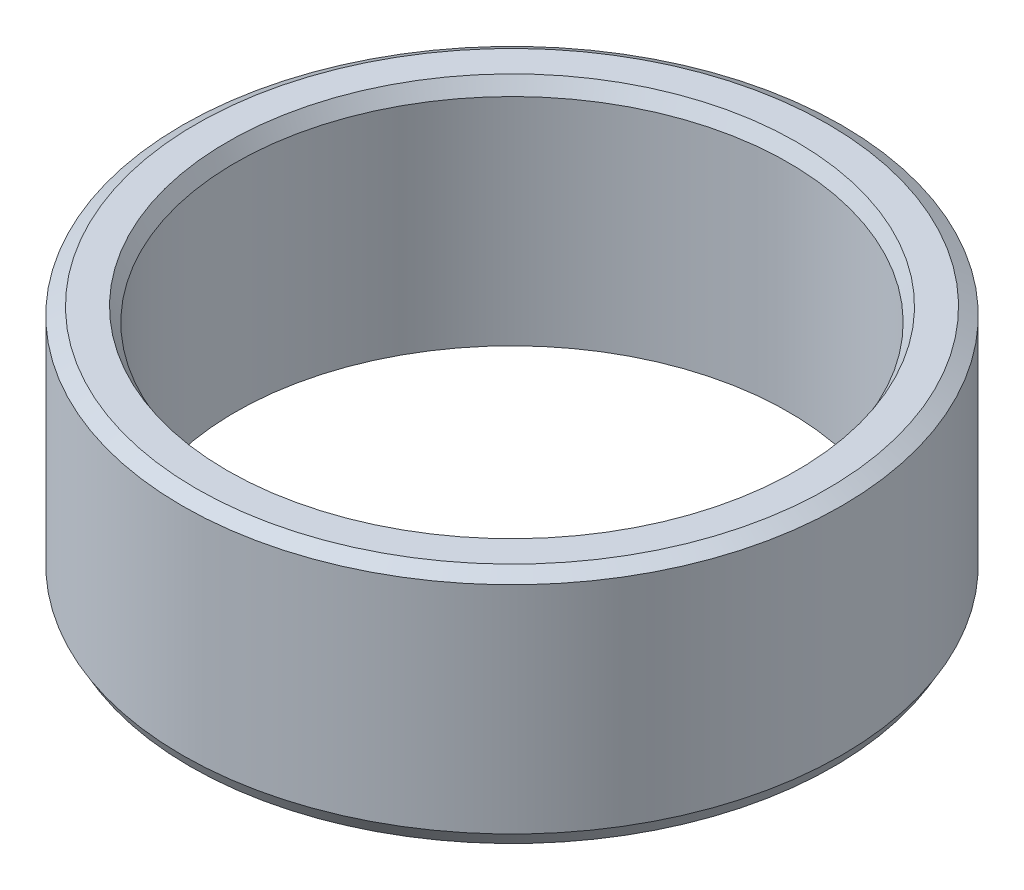
ISO-10303-21;
HEADER;
FILE_DESCRIPTION(('STEP AP214'),'2;1');
FILE_NAME('part.step','',(''),(''),'','','');
FILE_SCHEMA(('AUTOMOTIVE_DESIGN { 1 0 10303 214 1 1 1 1 }'));
ENDSEC;
DATA;
#1=APPLICATION_CONTEXT('core data for automotive mechanical design processes');
#2=APPLICATION_PROTOCOL_DEFINITION('international standard','automotive_design',2000,#1);
#3=PRODUCT_CONTEXT('',#1,'mechanical');
#4=PRODUCT('Part','Part','',(#3));
#5=PRODUCT_RELATED_PRODUCT_CATEGORY('part','',(#4));
#6=PRODUCT_DEFINITION_FORMATION('','',#4);
#7=PRODUCT_DEFINITION_CONTEXT('part definition',#1,'design');
#8=PRODUCT_DEFINITION('design','',#6,#7);
#9=PRODUCT_DEFINITION_SHAPE('','',#8);
#10=(LENGTH_UNIT() NAMED_UNIT(*) SI_UNIT(.MILLI.,.METRE.));
#11=(NAMED_UNIT(*) PLANE_ANGLE_UNIT() SI_UNIT($,.RADIAN.));
#12=(NAMED_UNIT(*) SI_UNIT($,.STERADIAN.) SOLID_ANGLE_UNIT());
#13=UNCERTAINTY_MEASURE_WITH_UNIT(LENGTH_MEASURE(1.E-05),#10,'distance_accuracy_value','');
#14=(GEOMETRIC_REPRESENTATION_CONTEXT(3) GLOBAL_UNCERTAINTY_ASSIGNED_CONTEXT((#13)) GLOBAL_UNIT_ASSIGNED_CONTEXT((#10,
#11,#12)) REPRESENTATION_CONTEXT('',''));
#15=CARTESIAN_POINT('',(0.,0.,0.));
#16=DIRECTION('',(0.,0.,1.));
#17=DIRECTION('',(1.,0.,0.));
#18=AXIS2_PLACEMENT_3D('',#15,#16,#17);
#19=CARTESIAN_POINT('',(0.,36.0681997251808,0.));
#20=DIRECTION('',(0.,-1.,0.));
#21=DIRECTION('',(0.,0.,-1.));
#22=AXIS2_PLACEMENT_3D('',#19,#20,#21);
#23=CYLINDRICAL_SURFACE('',#22,50.);
#24=CARTESIAN_POINT('',(0.,2.11110126652667,0.));
#25=DIRECTION('',(0.,1.,0.));
#26=DIRECTION('',(0.,0.,1.));
#27=AXIS2_PLACEMENT_3D('',#24,#25,#26);
#28=CIRCLE('',#27,50.);
#29=CARTESIAN_POINT('',(0.,2.11110126652667,50.));
#30=VERTEX_POINT('',#29);
#31=EDGE_CURVE('E10',#30,#30,#28,.T.);
#32=ORIENTED_EDGE('',*,*,#31,.T.);
#33=EDGE_LOOP('',(#32));
#34=FACE_BOUND('',#33,.T.);
#35=CARTESIAN_POINT('',(0.,34.849354840665,0.));
#36=DIRECTION('',(0.,1.,0.));
#37=DIRECTION('',(0.,0.,1.));
#38=AXIS2_PLACEMENT_3D('',#35,#36,#37);
#39=CIRCLE('',#38,50.);
#40=CARTESIAN_POINT('',(0.,34.849354840665,50.));
#41=VERTEX_POINT('',#40);
#42=EDGE_CURVE('E50',#41,#41,#39,.F.);
#43=ORIENTED_EDGE('',*,*,#42,.T.);
#44=EDGE_LOOP('',(#43));
#45=FACE_BOUND('',#44,.T.);
#46=ADVANCED_FACE('F39',(#34,#45),#23,.T.);
#47=CARTESIAN_POINT('',(0.,36.0681997251808,0.));
#48=DIRECTION('',(0.,1.,0.));
#49=DIRECTION('',(0.,0.,1.));
#50=AXIS2_PLACEMENT_3D('',#47,#48,#49);
#51=PLANE('',#50);
#52=CARTESIAN_POINT('',(0.,36.0681997251808,0.));
#53=DIRECTION('',(0.,1.,0.));
#54=DIRECTION('',(0.,0.,1.));
#55=AXIS2_PLACEMENT_3D('',#52,#53,#54);
#56=CIRCLE('',#55,43.1664887311371);
#57=CARTESIAN_POINT('',(0.,36.0681997251808,43.1664887311371));
#58=VERTEX_POINT('',#57);
#59=EDGE_CURVE('E58',#58,#58,#56,.F.);
#60=ORIENTED_EDGE('',*,*,#59,.T.);
#61=EDGE_LOOP('',(#60));
#62=FACE_BOUND('',#61,.T.);
#63=CARTESIAN_POINT('',(0.,36.0681997251808,0.));
#64=DIRECTION('',(0.,1.,0.));
#65=DIRECTION('',(0.,0.,1.));
#66=AXIS2_PLACEMENT_3D('',#63,#64,#65);
#67=CIRCLE('',#66,47.8888987334733);
#68=CARTESIAN_POINT('',(0.,36.0681997251808,47.8888987334733));
#69=VERTEX_POINT('',#68);
#70=EDGE_CURVE('E61',#69,#69,#67,.T.);
#71=ORIENTED_EDGE('',*,*,#70,.T.);
#72=EDGE_LOOP('',(#71));
#73=FACE_BOUND('',#72,.T.);
#74=ADVANCED_FACE('F88',(#62,#73),#51,.T.);
#75=CARTESIAN_POINT('',(0.,0.,0.));
#76=DIRECTION('',(0.,1.,0.));
#77=DIRECTION('',(0.,0.,1.));
#78=AXIS2_PLACEMENT_3D('',#75,#76,#77);
#79=PLANE('',#78);
#80=CARTESIAN_POINT('',(0.,0.,0.));
#81=DIRECTION('',(0.,1.,0.));
#82=DIRECTION('',(0.,0.,1.));
#83=AXIS2_PLACEMENT_3D('',#80,#81,#82);
#84=CIRCLE('',#83,44.0587451131481);
#85=CARTESIAN_POINT('',(0.,0.,44.0587451131481));
#86=VERTEX_POINT('',#85);
#87=EDGE_CURVE('E51',#86,#86,#84,.T.);
#88=ORIENTED_EDGE('',*,*,#87,.T.);
#89=EDGE_LOOP('',(#88));
#90=FACE_BOUND('',#89,.T.);
#91=CARTESIAN_POINT('',(0.,0.,0.));
#92=DIRECTION('',(0.,1.,0.));
#93=DIRECTION('',(0.,0.,1.));
#94=AXIS2_PLACEMENT_3D('',#91,#92,#93);
#95=CIRCLE('',#94,48.7811551154843);
#96=CARTESIAN_POINT('',(0.,0.,48.7811551154843));
#97=VERTEX_POINT('',#96);
#98=EDGE_CURVE('E54',#97,#97,#95,.F.);
#99=ORIENTED_EDGE('',*,*,#98,.T.);
#100=EDGE_LOOP('',(#99));
#101=FACE_BOUND('',#100,.T.);
#102=ADVANCED_FACE('F83',(#90,#101),#79,.F.);
#103=CARTESIAN_POINT('',(0.,36.0681997251808,0.));
#104=DIRECTION('',(0.,-1.,0.));
#105=DIRECTION('',(0.,0.,-1.));
#106=AXIS2_PLACEMENT_3D('',#103,#104,#105);
#107=CYLINDRICAL_SURFACE('',#106,41.9476438466214);
#108=CARTESIAN_POINT('',(0.,33.9570984586541,0.));
#109=DIRECTION('',(0.,1.,0.));
#110=DIRECTION('',(0.,0.,1.));
#111=AXIS2_PLACEMENT_3D('',#108,#109,#110);
#112=CIRCLE('',#111,41.9476438466214);
#113=CARTESIAN_POINT('',(0.,33.9570984586541,41.9476438466214));
#114=VERTEX_POINT('',#113);
#115=EDGE_CURVE('E67',#114,#114,#112,.T.);
#116=ORIENTED_EDGE('',*,*,#115,.T.);
#117=EDGE_LOOP('',(#116));
#118=FACE_BOUND('',#117,.T.);
#119=CARTESIAN_POINT('',(0.,1.21884488451576,0.));
#120=DIRECTION('',(0.,1.,0.));
#121=DIRECTION('',(0.,0.,1.));
#122=AXIS2_PLACEMENT_3D('',#119,#120,#121);
#123=CIRCLE('',#122,41.9476438466214);
#124=CARTESIAN_POINT('',(0.,1.21884488451576,41.9476438466214));
#125=VERTEX_POINT('',#124);
#126=EDGE_CURVE('E69',#125,#125,#123,.F.);
#127=ORIENTED_EDGE('',*,*,#126,.T.);
#128=EDGE_LOOP('',(#127));
#129=FACE_BOUND('',#128,.T.);
#130=ADVANCED_FACE('F71',(#118,#129),#107,.F.);
#131=CARTESIAN_POINT('',(0.,33.9570984586541,0.));
#132=DIRECTION('',(0.,1.,0.));
#133=DIRECTION('',(0.,0.,1.));
#134=AXIS2_PLACEMENT_3D('',#131,#132,#133);
#135=CONICAL_SURFACE('',#134,41.9476438466214,0.523598775598301);
#136=ORIENTED_EDGE('',*,*,#59,.F.);
#137=EDGE_LOOP('',(#136));
#138=FACE_BOUND('',#137,.T.);
#139=ORIENTED_EDGE('',*,*,#115,.F.);
#140=EDGE_LOOP('',(#139));
#141=FACE_BOUND('',#140,.T.);
#142=ADVANCED_FACE('F77',(#138,#141),#135,.F.);
#143=CARTESIAN_POINT('',(0.,0.,0.));
#144=DIRECTION('',(0.,-1.,0.));
#145=DIRECTION('',(0.,0.,-1.));
#146=AXIS2_PLACEMENT_3D('',#143,#144,#145);
#147=CONICAL_SURFACE('',#146,44.0587451131481,1.04719755119659);
#148=ORIENTED_EDGE('',*,*,#126,.F.);
#149=EDGE_LOOP('',(#148));
#150=FACE_BOUND('',#149,.T.);
#151=ORIENTED_EDGE('',*,*,#87,.F.);
#152=EDGE_LOOP('',(#151));
#153=FACE_BOUND('',#152,.T.);
#154=ADVANCED_FACE('F73',(#150,#153),#147,.F.);
#155=CARTESIAN_POINT('',(0.,2.11110126652667,0.));
#156=DIRECTION('',(0.,1.,0.));
#157=DIRECTION('',(0.,0.,1.));
#158=AXIS2_PLACEMENT_3D('',#155,#156,#157);
#159=CONICAL_SURFACE('',#158,50.,0.523598775598301);
#160=ORIENTED_EDGE('',*,*,#98,.F.);
#161=EDGE_LOOP('',(#160));
#162=FACE_BOUND('',#161,.T.);
#163=ORIENTED_EDGE('',*,*,#31,.F.);
#164=EDGE_LOOP('',(#163));
#165=FACE_BOUND('',#164,.T.);
#166=ADVANCED_FACE('F76',(#162,#165),#159,.T.);
#167=CARTESIAN_POINT('',(0.,36.0681997251808,0.));
#168=DIRECTION('',(0.,-1.,0.));
#169=DIRECTION('',(0.,0.,-1.));
#170=AXIS2_PLACEMENT_3D('',#167,#168,#169);
#171=CONICAL_SURFACE('',#170,47.8888987334733,1.04719755119659);
#172=ORIENTED_EDGE('',*,*,#42,.F.);
#173=EDGE_LOOP('',(#172));
#174=FACE_BOUND('',#173,.T.);
#175=ORIENTED_EDGE('',*,*,#70,.F.);
#176=EDGE_LOOP('',(#175));
#177=FACE_BOUND('',#176,.T.);
#178=ADVANCED_FACE('F45',(#174,#177),#171,.T.);
#179=CLOSED_SHELL('',(#46,#74,#102,#130,#142,#154,#166,#178));
#180=MANIFOLD_SOLID_BREP('B2',#179);
#181=ADVANCED_BREP_SHAPE_REPRESENTATION('',(#18,#180),#14);
#182=SHAPE_DEFINITION_REPRESENTATION(#9,#181);
ENDSEC;
END-ISO-10303-21;
